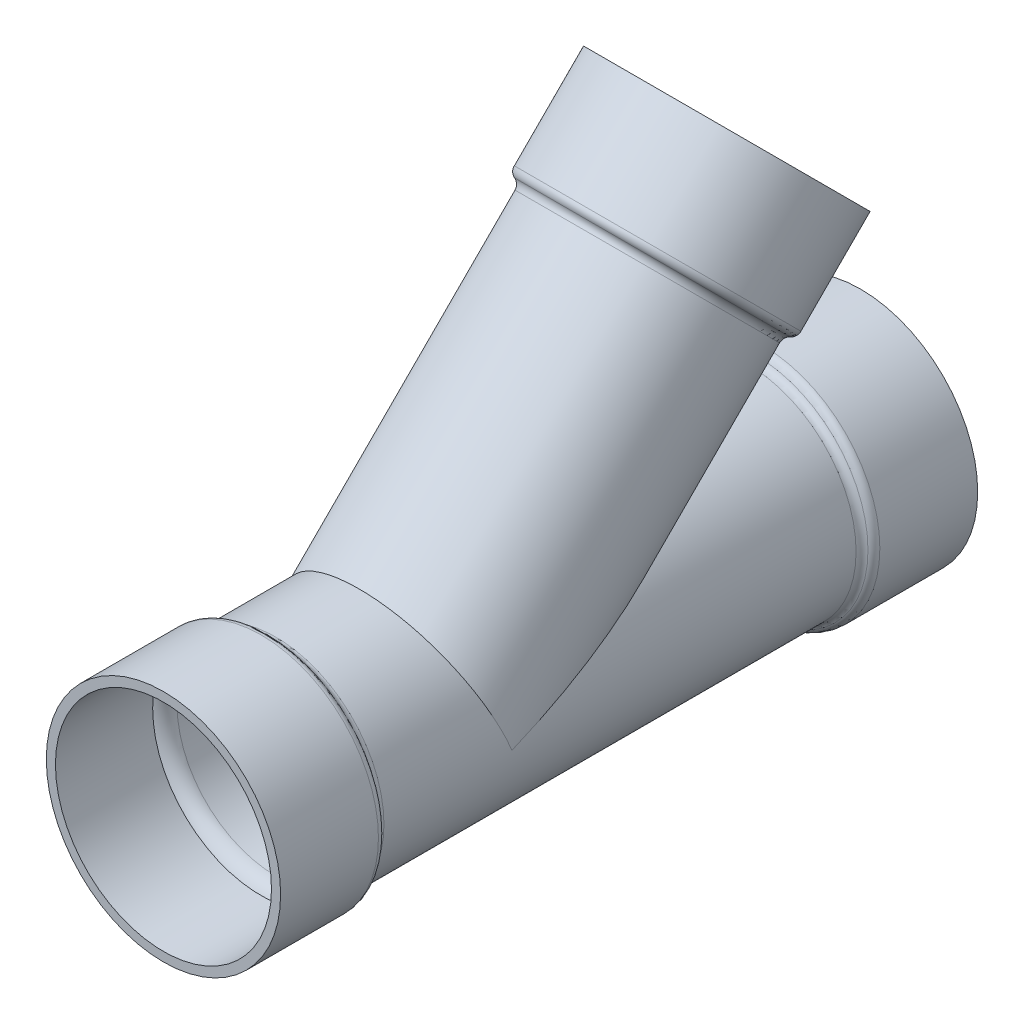
ISO-10303-21;
HEADER;
FILE_DESCRIPTION(('STEP AP214'),'2;1');
FILE_NAME('part.step','',(''),(''),'','','');
FILE_SCHEMA(('AUTOMOTIVE_DESIGN { 1 0 10303 214 1 1 1 1 }'));
ENDSEC;
DATA;
#1=APPLICATION_CONTEXT('core data for automotive mechanical design processes');
#2=APPLICATION_PROTOCOL_DEFINITION('international standard','automotive_design',2000,#1);
#3=PRODUCT_CONTEXT('',#1,'mechanical');
#4=PRODUCT('Part','Part','',(#3));
#5=PRODUCT_RELATED_PRODUCT_CATEGORY('part','',(#4));
#6=PRODUCT_DEFINITION_FORMATION('','',#4);
#7=PRODUCT_DEFINITION_CONTEXT('part definition',#1,'design');
#8=PRODUCT_DEFINITION('design','',#6,#7);
#9=PRODUCT_DEFINITION_SHAPE('','',#8);
#10=(LENGTH_UNIT() NAMED_UNIT(*) SI_UNIT(.MILLI.,.METRE.));
#11=(NAMED_UNIT(*) PLANE_ANGLE_UNIT() SI_UNIT($,.RADIAN.));
#12=(NAMED_UNIT(*) SI_UNIT($,.STERADIAN.) SOLID_ANGLE_UNIT());
#13=UNCERTAINTY_MEASURE_WITH_UNIT(LENGTH_MEASURE(1.E-05),#10,'distance_accuracy_value','');
#14=(GEOMETRIC_REPRESENTATION_CONTEXT(3) GLOBAL_UNCERTAINTY_ASSIGNED_CONTEXT((#13)) GLOBAL_UNIT_ASSIGNED_CONTEXT((#10,
#11,#12)) REPRESENTATION_CONTEXT('',''));
#15=CARTESIAN_POINT('',(0.,0.,0.));
#16=DIRECTION('',(0.,0.,1.));
#17=DIRECTION('',(1.,0.,0.));
#18=AXIS2_PLACEMENT_3D('',#15,#16,#17);
#19=CARTESIAN_POINT('',(0.,0.,84.1375));
#20=DIRECTION('',(0.,-0.707106781186549,0.707106781186546));
#21=DIRECTION('',(0.,-0.707106781186546,-0.707106781186549));
#22=AXIS2_PLACEMENT_3D('',#19,#20,#21);
#23=CYLINDRICAL_SURFACE('',#22,77.0255);
#24=CARTESIAN_POINT('',(0.,189.501384667397,-105.363884667396));
#25=DIRECTION('',(0.,-0.707106781186549,0.707106781186546));
#26=DIRECTION('',(0.,-0.707106781186546,-0.707106781186549));
#27=AXIS2_PLACEMENT_3D('',#24,#25,#26);
#28=CIRCLE('',#27,77.0255);
#29=CARTESIAN_POINT('',(0.,135.036131293112,-159.82913804168));
#30=VERTEX_POINT('',#29);
#31=EDGE_CURVE('E82',#30,#30,#28,.T.);
#32=ORIENTED_EDGE('',*,*,#31,.F.);
#33=EDGE_LOOP('',(#32));
#34=FACE_BOUND('',#33,.T.);
#35=CARTESIAN_POINT('',(0.,0.,84.1375));
#36=DIRECTION('',(0.,-0.923879532511286,-0.382683432365091));
#37=DIRECTION('',(0.,-0.382683432365091,0.923879532511286));
#38=AXIS2_PLACEMENT_3D('',#35,#36,#37);
#39=ELLIPSE('',#38,201.27733130217,77.0255);
#40=CARTESIAN_POINT('',(-77.0255,0.,84.1375));
#41=VERTEX_POINT('',#40);
#42=CARTESIAN_POINT('',(77.0255,1.25958571793709E-13,84.1374999999999));
#43=VERTEX_POINT('',#42);
#44=EDGE_CURVE('E74',#41,#43,#39,.T.);
#45=ORIENTED_EDGE('',*,*,#44,.T.);
#46=CARTESIAN_POINT('',(0.,0.,84.1375));
#47=DIRECTION('',(0.,-0.382683432365091,0.923879532511286));
#48=DIRECTION('',(0.,-0.923879532511286,-0.382683432365091));
#49=AXIS2_PLACEMENT_3D('',#46,#47,#48);
#50=ELLIPSE('',#49,83.3718004236218,77.0255);
#51=EDGE_CURVE('E60',#43,#41,#50,.T.);
#52=ORIENTED_EDGE('',*,*,#51,.T.);
#53=EDGE_LOOP('',(#45,#52));
#54=FACE_BOUND('',#53,.T.);
#55=ADVANCED_FACE('F42',(#34,#54),#23,.F.);
#56=CARTESIAN_POINT('',(0.,0.,168.70511138535));
#57=DIRECTION('',(0.,0.,1.));
#58=DIRECTION('',(1.,0.,0.));
#59=AXIS2_PLACEMENT_3D('',#56,#57,#58);
#60=CYLINDRICAL_SURFACE('',#59,84.1375);
#61=CARTESIAN_POINT('',(0.,0.,-183.857928285113));
#62=DIRECTION('',(0.,0.,1.));
#63=DIRECTION('',(1.,0.,0.));
#64=AXIS2_PLACEMENT_3D('',#61,#62,#63);
#65=CIRCLE('',#64,84.1375);
#66=CARTESIAN_POINT('',(84.1375,0.,-183.857928285113));
#67=VERTEX_POINT('',#66);
#68=EDGE_CURVE('E130',#67,#67,#65,.T.);
#69=ORIENTED_EDGE('',*,*,#68,.T.);
#70=EDGE_LOOP('',(#69));
#71=FACE_BOUND('',#70,.T.);
#72=CARTESIAN_POINT('',(0.,0.,183.857928285113));
#73=DIRECTION('',(0.,0.,1.));
#74=DIRECTION('',(1.,0.,0.));
#75=AXIS2_PLACEMENT_3D('',#72,#73,#74);
#76=CIRCLE('',#75,84.1375);
#77=CARTESIAN_POINT('',(84.1375,0.,183.857928285113));
#78=VERTEX_POINT('',#77);
#79=EDGE_CURVE('E126',#78,#78,#76,.T.);
#80=ORIENTED_EDGE('',*,*,#79,.F.);
#81=EDGE_LOOP('',(#80));
#82=FACE_BOUND('',#81,.T.);
#83=CARTESIAN_POINT('',(0.,0.,84.1375));
#84=DIRECTION('',(0.,-0.382683432365091,0.923879532511286));
#85=DIRECTION('',(0.,0.923879532511286,0.382683432365091));
#86=AXIS2_PLACEMENT_3D('',#83,#84,#85);
#87=ELLIPSE('',#86,91.0697737521013,84.1375);
#88=CARTESIAN_POINT('',(-84.1375,0.,84.1375));
#89=VERTEX_POINT('',#88);
#90=CARTESIAN_POINT('',(84.1375,0.,84.1375));
#91=VERTEX_POINT('',#90);
#92=EDGE_CURVE('E11',#89,#91,#87,.F.);
#93=ORIENTED_EDGE('',*,*,#92,.F.);
#94=CARTESIAN_POINT('',(0.,0.,84.1375));
#95=DIRECTION('',(0.,0.923879532511286,0.382683432365091));
#96=DIRECTION('',(0.,-0.382683432365091,0.923879532511286));
#97=AXIS2_PLACEMENT_3D('',#94,#95,#96);
#98=ELLIPSE('',#97,219.861882914572,84.1375);
#99=EDGE_CURVE('E51',#91,#89,#98,.T.);
#100=ORIENTED_EDGE('',*,*,#99,.F.);
#101=EDGE_LOOP('',(#93,#100));
#102=FACE_BOUND('',#101,.T.);
#103=ADVANCED_FACE('F149',(#71,#82,#102),#60,.T.);
#104=CARTESIAN_POINT('',(0.,0.,271.4625));
#105=DIRECTION('',(0.,0.,-1.));
#106=DIRECTION('',(-1.,0.,0.));
#107=AXIS2_PLACEMENT_3D('',#104,#105,#106);
#108=PLANE('',#107);
#109=CARTESIAN_POINT('',(0.,0.,271.4625));
#110=DIRECTION('',(0.,0.,1.));
#111=DIRECTION('',(1.,0.,0.));
#112=AXIS2_PLACEMENT_3D('',#109,#110,#111);
#113=CIRCLE('',#112,84.1374999999999);
#114=CARTESIAN_POINT('',(84.1374999999999,0.,271.4625));
#115=VERTEX_POINT('',#114);
#116=EDGE_CURVE('E189',#115,#115,#113,.T.);
#117=ORIENTED_EDGE('',*,*,#116,.F.);
#118=EDGE_LOOP('',(#117));
#119=FACE_BOUND('',#118,.T.);
#120=CARTESIAN_POINT('',(0.,0.,271.4625));
#121=DIRECTION('',(0.,0.,1.));
#122=DIRECTION('',(1.,0.,0.));
#123=AXIS2_PLACEMENT_3D('',#120,#121,#122);
#124=CIRCLE('',#123,91.2495);
#125=CARTESIAN_POINT('',(91.2495,0.,271.4625));
#126=VERTEX_POINT('',#125);
#127=EDGE_CURVE('E114',#126,#126,#124,.T.);
#128=ORIENTED_EDGE('',*,*,#127,.T.);
#129=EDGE_LOOP('',(#128));
#130=FACE_BOUND('',#129,.T.);
#131=ADVANCED_FACE('F44',(#119,#130),#108,.F.);
#132=CARTESIAN_POINT('',(0.,91.2495,-271.4625));
#133=DIRECTION('',(0.,0.,1.));
#134=DIRECTION('',(1.,0.,0.));
#135=AXIS2_PLACEMENT_3D('',#132,#133,#134);
#136=PLANE('',#135);
#137=CARTESIAN_POINT('',(0.,0.,-271.4625));
#138=DIRECTION('',(0.,0.,1.));
#139=DIRECTION('',(1.,0.,0.));
#140=AXIS2_PLACEMENT_3D('',#137,#138,#139);
#141=CIRCLE('',#140,84.1375);
#142=CARTESIAN_POINT('',(84.1375,0.,-271.4625));
#143=VERTEX_POINT('',#142);
#144=EDGE_CURVE('E184',#143,#143,#141,.T.);
#145=ORIENTED_EDGE('',*,*,#144,.T.);
#146=EDGE_LOOP('',(#145));
#147=FACE_BOUND('',#146,.T.);
#148=CARTESIAN_POINT('',(0.,0.,-271.4625));
#149=DIRECTION('',(0.,0.,1.));
#150=DIRECTION('',(1.,0.,0.));
#151=AXIS2_PLACEMENT_3D('',#148,#149,#150);
#152=CIRCLE('',#151,91.2495);
#153=CARTESIAN_POINT('',(91.2495,0.,-271.4625));
#154=VERTEX_POINT('',#153);
#155=EDGE_CURVE('E142',#154,#154,#152,.T.);
#156=ORIENTED_EDGE('',*,*,#155,.F.);
#157=EDGE_LOOP('',(#156));
#158=FACE_BOUND('',#157,.T.);
#159=ADVANCED_FACE('F157',(#147,#158),#136,.F.);
#160=CARTESIAN_POINT('',(0.,0.,168.70511138535));
#161=DIRECTION('',(0.,0.,1.));
#162=DIRECTION('',(1.,0.,0.));
#163=AXIS2_PLACEMENT_3D('',#160,#161,#162);
#164=CYLINDRICAL_SURFACE('',#163,91.2495);
#165=CARTESIAN_POINT('',(0.,0.,-195.2625));
#166=DIRECTION('',(0.,0.,1.));
#167=DIRECTION('',(1.,0.,0.));
#168=AXIS2_PLACEMENT_3D('',#165,#166,#167);
#169=CIRCLE('',#168,91.2495);
#170=CARTESIAN_POINT('',(91.2495,0.,-195.2625));
#171=VERTEX_POINT('',#170);
#172=EDGE_CURVE('E138',#171,#171,#169,.T.);
#173=ORIENTED_EDGE('',*,*,#172,.F.);
#174=EDGE_LOOP('',(#173));
#175=FACE_BOUND('',#174,.T.);
#176=ORIENTED_EDGE('',*,*,#155,.T.);
#177=EDGE_LOOP('',(#176));
#178=FACE_BOUND('',#177,.T.);
#179=ADVANCED_FACE('F173',(#175,#178),#164,.T.);
#180=CARTESIAN_POINT('',(0.,0.,-195.2625));
#181=DIRECTION('',(0.,0.,1.));
#182=DIRECTION('',(1.,0.,0.));
#183=AXIS2_PLACEMENT_3D('',#180,#181,#182);
#184=TOROIDAL_SURFACE('',#183,84.8995,6.34999999999998);
#185=CARTESIAN_POINT('',(0.,0.,-189.560214142557));
#186=DIRECTION('',(0.,0.,1.));
#187=DIRECTION('',(1.,0.,0.));
#188=AXIS2_PLACEMENT_3D('',#185,#186,#187);
#189=CIRCLE('',#188,87.6935);
#190=CARTESIAN_POINT('',(87.6935,0.,-189.560214142557));
#191=VERTEX_POINT('',#190);
#192=EDGE_CURVE('E134',#191,#191,#189,.T.);
#193=ORIENTED_EDGE('',*,*,#192,.F.);
#194=EDGE_LOOP('',(#193));
#195=FACE_BOUND('',#194,.T.);
#196=ORIENTED_EDGE('',*,*,#172,.T.);
#197=EDGE_LOOP('',(#196));
#198=FACE_BOUND('',#197,.T.);
#199=ADVANCED_FACE('F169',(#195,#198),#184,.T.);
#200=CARTESIAN_POINT('',(0.,0.,-183.857928285113));
#201=DIRECTION('',(0.,0.,1.));
#202=DIRECTION('',(1.,0.,0.));
#203=AXIS2_PLACEMENT_3D('',#200,#201,#202);
#204=TOROIDAL_SURFACE('',#203,90.4875,6.34999999999999);
#205=ORIENTED_EDGE('',*,*,#68,.F.);
#206=EDGE_LOOP('',(#205));
#207=FACE_BOUND('',#206,.T.);
#208=ORIENTED_EDGE('',*,*,#192,.T.);
#209=EDGE_LOOP('',(#208));
#210=FACE_BOUND('',#209,.T.);
#211=ADVANCED_FACE('F166',(#207,#210),#204,.F.);
#212=CARTESIAN_POINT('',(0.,0.,183.857928285113));
#213=DIRECTION('',(0.,0.,1.));
#214=DIRECTION('',(1.,0.,0.));
#215=AXIS2_PLACEMENT_3D('',#212,#213,#214);
#216=TOROIDAL_SURFACE('',#215,90.4875,6.34999999999999);
#217=CARTESIAN_POINT('',(0.,0.,189.560214142557));
#218=DIRECTION('',(0.,0.,1.));
#219=DIRECTION('',(1.,0.,0.));
#220=AXIS2_PLACEMENT_3D('',#217,#218,#219);
#221=CIRCLE('',#220,87.6935);
#222=CARTESIAN_POINT('',(87.6935,0.,189.560214142557));
#223=VERTEX_POINT('',#222);
#224=EDGE_CURVE('E122',#223,#223,#221,.T.);
#225=ORIENTED_EDGE('',*,*,#224,.F.);
#226=EDGE_LOOP('',(#225));
#227=FACE_BOUND('',#226,.T.);
#228=ORIENTED_EDGE('',*,*,#79,.T.);
#229=EDGE_LOOP('',(#228));
#230=FACE_BOUND('',#229,.T.);
#231=ADVANCED_FACE('F164',(#227,#230),#216,.F.);
#232=CARTESIAN_POINT('',(0.,0.,195.2625));
#233=DIRECTION('',(0.,0.,1.));
#234=DIRECTION('',(1.,0.,0.));
#235=AXIS2_PLACEMENT_3D('',#232,#233,#234);
#236=TOROIDAL_SURFACE('',#235,84.8995,6.34999999999998);
#237=CARTESIAN_POINT('',(0.,0.,195.2625));
#238=DIRECTION('',(0.,0.,1.));
#239=DIRECTION('',(1.,0.,0.));
#240=AXIS2_PLACEMENT_3D('',#237,#238,#239);
#241=CIRCLE('',#240,91.2495);
#242=CARTESIAN_POINT('',(91.2495,0.,195.2625));
#243=VERTEX_POINT('',#242);
#244=EDGE_CURVE('E118',#243,#243,#241,.T.);
#245=ORIENTED_EDGE('',*,*,#244,.F.);
#246=EDGE_LOOP('',(#245));
#247=FACE_BOUND('',#246,.T.);
#248=ORIENTED_EDGE('',*,*,#224,.T.);
#249=EDGE_LOOP('',(#248));
#250=FACE_BOUND('',#249,.T.);
#251=ADVANCED_FACE('F257',(#247,#250),#236,.T.);
#252=CARTESIAN_POINT('',(0.,0.,168.70511138535));
#253=DIRECTION('',(0.,0.,1.));
#254=DIRECTION('',(1.,0.,0.));
#255=AXIS2_PLACEMENT_3D('',#252,#253,#254);
#256=CYLINDRICAL_SURFACE('',#255,91.2495);
#257=ORIENTED_EDGE('',*,*,#127,.F.);
#258=EDGE_LOOP('',(#257));
#259=FACE_BOUND('',#258,.T.);
#260=ORIENTED_EDGE('',*,*,#244,.T.);
#261=EDGE_LOOP('',(#260));
#262=FACE_BOUND('',#261,.T.);
#263=ADVANCED_FACE('F240',(#259,#262),#256,.T.);
#264=CARTESIAN_POINT('',(0.,0.,84.1375));
#265=DIRECTION('',(0.,-0.707106781186549,0.707106781186546));
#266=DIRECTION('',(0.,-0.707106781186546,-0.707106781186549));
#267=AXIS2_PLACEMENT_3D('',#264,#265,#266);
#268=CYLINDRICAL_SURFACE('',#267,84.1375);
#269=CARTESIAN_POINT('',(0.,189.501384667397,-105.363884667396));
#270=DIRECTION('',(0.,-0.707106781186549,0.707106781186546));
#271=DIRECTION('',(0.,-0.707106781186546,-0.707106781186549));
#272=AXIS2_PLACEMENT_3D('',#269,#270,#271);
#273=CIRCLE('',#272,84.1375);
#274=CARTESIAN_POINT('',(0.,130.007187865314,-164.858081469479));
#275=VERTEX_POINT('',#274);
#276=EDGE_CURVE('E98',#275,#275,#273,.T.);
#277=ORIENTED_EDGE('',*,*,#276,.T.);
#278=EDGE_LOOP('',(#277));
#279=FACE_BOUND('',#278,.T.);
#280=ORIENTED_EDGE('',*,*,#99,.T.);
#281=ORIENTED_EDGE('',*,*,#92,.T.);
#282=EDGE_LOOP('',(#280,#281));
#283=FACE_BOUND('',#282,.T.);
#284=ADVANCED_FACE('F148',(#279,#283),#268,.T.);
#285=CARTESIAN_POINT('',(0.,315.970311619818,-102.786531160054));
#286=DIRECTION('',(0.,-0.707106781186549,0.707106781186546));
#287=DIRECTION('',(0.,-0.707106781186546,-0.707106781186549));
#288=AXIS2_PLACEMENT_3D('',#285,#286,#287);
#289=PLANE('',#288);
#290=CARTESIAN_POINT('',(0.,251.447171389937,-167.309671389936));
#291=DIRECTION('',(0.,-0.707106781186549,0.707106781186546));
#292=DIRECTION('',(0.,-0.707106781186546,-0.707106781186549));
#293=AXIS2_PLACEMENT_3D('',#290,#291,#292);
#294=CIRCLE('',#293,84.1375);
#295=CARTESIAN_POINT('',(0.,191.952974587854,-226.803868192019));
#296=VERTEX_POINT('',#295);
#297=EDGE_CURVE('E94',#296,#296,#294,.T.);
#298=ORIENTED_EDGE('',*,*,#297,.T.);
#299=EDGE_LOOP('',(#298));
#300=FACE_BOUND('',#299,.T.);
#301=CARTESIAN_POINT('',(0.,251.447171389937,-167.309671389936));
#302=DIRECTION('',(0.,-0.707106781186549,0.707106781186546));
#303=DIRECTION('',(0.,-0.707106781186546,-0.707106781186549));
#304=AXIS2_PLACEMENT_3D('',#301,#302,#303);
#305=CIRCLE('',#304,91.2495);
#306=CARTESIAN_POINT('',(0.,186.924031160055,-231.832811619818));
#307=VERTEX_POINT('',#306);
#308=EDGE_CURVE('E110',#307,#307,#305,.T.);
#309=ORIENTED_EDGE('',*,*,#308,.F.);
#310=EDGE_LOOP('',(#309));
#311=FACE_BOUND('',#310,.T.);
#312=ADVANCED_FACE('F239',(#300,#311),#289,.F.);
#313=CARTESIAN_POINT('',(0.,0.,84.1375));
#314=DIRECTION('',(0.,-0.707106781186549,0.707106781186546));
#315=DIRECTION('',(0.,-0.707106781186546,-0.707106781186549));
#316=AXIS2_PLACEMENT_3D('',#313,#314,#315);
#317=CYLINDRICAL_SURFACE('',#316,91.2495);
#318=CARTESIAN_POINT('',(0.,197.565634663522,-113.428134663521));
#319=DIRECTION('',(0.,-0.707106781186549,0.707106781186546));
#320=DIRECTION('',(0.,-0.707106781186546,-0.707106781186549));
#321=AXIS2_PLACEMENT_3D('',#318,#319,#320);
#322=CIRCLE('',#321,91.2495000000001);
#323=CARTESIAN_POINT('',(0.,133.04249443364,-177.951274893403));
#324=VERTEX_POINT('',#323);
#325=EDGE_CURVE('E106',#324,#324,#322,.T.);
#326=ORIENTED_EDGE('',*,*,#325,.F.);
#327=EDGE_LOOP('',(#326));
#328=FACE_BOUND('',#327,.T.);
#329=ORIENTED_EDGE('',*,*,#308,.T.);
#330=EDGE_LOOP('',(#329));
#331=FACE_BOUND('',#330,.T.);
#332=ADVANCED_FACE('F248',(#328,#331),#317,.T.);
#333=CARTESIAN_POINT('',(0.,197.565634663522,-113.428134663521));
#334=DIRECTION('',(0.,-0.707106781186549,0.707106781186546));
#335=DIRECTION('',(0.,-0.707106781186546,-0.707106781186549));
#336=AXIS2_PLACEMENT_3D('',#333,#334,#335);
#337=TOROIDAL_SURFACE('',#336,84.8995,6.35000000000002);
#338=CARTESIAN_POINT('',(0.,193.533509665459,-109.396009665459));
#339=DIRECTION('',(0.,-0.707106781186549,0.707106781186546));
#340=DIRECTION('',(0.,-0.707106781186546,-0.707106781186549));
#341=AXIS2_PLACEMENT_3D('',#338,#339,#340);
#342=CIRCLE('',#341,87.6935);
#343=CARTESIAN_POINT('',(0.,131.524841149477,-171.404678181441));
#344=VERTEX_POINT('',#343);
#345=EDGE_CURVE('E102',#344,#344,#342,.T.);
#346=ORIENTED_EDGE('',*,*,#345,.F.);
#347=EDGE_LOOP('',(#346));
#348=FACE_BOUND('',#347,.T.);
#349=ORIENTED_EDGE('',*,*,#325,.T.);
#350=EDGE_LOOP('',(#349));
#351=FACE_BOUND('',#350,.T.);
#352=ADVANCED_FACE('F244',(#348,#351),#337,.T.);
#353=CARTESIAN_POINT('',(0.,189.501384667397,-105.363884667396));
#354=DIRECTION('',(0.,-0.707106781186549,0.707106781186546));
#355=DIRECTION('',(0.,-0.707106781186546,-0.707106781186549));
#356=AXIS2_PLACEMENT_3D('',#353,#354,#355);
#357=TOROIDAL_SURFACE('',#356,90.4875,6.34999999999996);
#358=ORIENTED_EDGE('',*,*,#276,.F.);
#359=EDGE_LOOP('',(#358));
#360=FACE_BOUND('',#359,.T.);
#361=ORIENTED_EDGE('',*,*,#345,.T.);
#362=EDGE_LOOP('',(#361));
#363=FACE_BOUND('',#362,.T.);
#364=ADVANCED_FACE('F235',(#360,#363),#357,.F.);
#365=CARTESIAN_POINT('',(0.,0.,84.1375));
#366=DIRECTION('',(0.,-0.707106781186549,0.707106781186546));
#367=DIRECTION('',(0.,-0.707106781186546,-0.707106781186549));
#368=AXIS2_PLACEMENT_3D('',#365,#366,#367);
#369=CYLINDRICAL_SURFACE('',#368,84.1375);
#370=CARTESIAN_POINT('',(0.,197.894922181461,-113.75742218146));
#371=DIRECTION('',(0.,-0.707106781186549,0.707106781186546));
#372=DIRECTION('',(0.,-0.707106781186546,-0.707106781186549));
#373=AXIS2_PLACEMENT_3D('',#370,#371,#372);
#374=CIRCLE('',#373,84.1375);
#375=CARTESIAN_POINT('',(0.,138.400725379378,-173.251618983543));
#376=VERTEX_POINT('',#375);
#377=EDGE_CURVE('E87',#376,#376,#374,.T.);
#378=ORIENTED_EDGE('',*,*,#377,.T.);
#379=EDGE_LOOP('',(#378));
#380=FACE_BOUND('',#379,.T.);
#381=ORIENTED_EDGE('',*,*,#297,.F.);
#382=EDGE_LOOP('',(#381));
#383=FACE_BOUND('',#382,.T.);
#384=ADVANCED_FACE('F231',(#380,#383),#369,.F.);
#385=CARTESIAN_POINT('',(0.,189.501384667397,-105.363884667396));
#386=DIRECTION('',(0.,-0.707106781186549,0.707106781186546));
#387=DIRECTION('',(0.,-0.707106781186546,-0.707106781186549));
#388=AXIS2_PLACEMENT_3D('',#385,#386,#387);
#389=TOROIDAL_SURFACE('',#388,90.4875,13.462);
#390=ORIENTED_EDGE('',*,*,#31,.T.);
#391=EDGE_LOOP('',(#390));
#392=FACE_BOUND('',#391,.T.);
#393=ORIENTED_EDGE('',*,*,#377,.F.);
#394=EDGE_LOOP('',(#393));
#395=FACE_BOUND('',#394,.T.);
#396=ADVANCED_FACE('F225',(#392,#395),#389,.T.);
#397=CARTESIAN_POINT('',(0.,0.,-183.857928285113));
#398=DIRECTION('',(0.,0.,1.));
#399=DIRECTION('',(1.,0.,0.));
#400=AXIS2_PLACEMENT_3D('',#397,#398,#399);
#401=TOROIDAL_SURFACE('',#400,90.4875,13.462);
#402=CARTESIAN_POINT('',(0.,0.,-183.857928285113));
#403=DIRECTION('',(0.,0.,1.));
#404=DIRECTION('',(1.,0.,0.));
#405=AXIS2_PLACEMENT_3D('',#402,#403,#404);
#406=CIRCLE('',#405,77.0255);
#407=CARTESIAN_POINT('',(77.0255,0.,-183.857928285113));
#408=VERTEX_POINT('',#407);
#409=EDGE_CURVE('E79',#408,#408,#406,.T.);
#410=ORIENTED_EDGE('',*,*,#409,.T.);
#411=EDGE_LOOP('',(#410));
#412=FACE_BOUND('',#411,.T.);
#413=CARTESIAN_POINT('',(0.,0.,-195.72818287379));
#414=DIRECTION('',(0.,0.,1.));
#415=DIRECTION('',(1.,0.,0.));
#416=AXIS2_PLACEMENT_3D('',#413,#414,#415);
#417=CIRCLE('',#416,84.1375);
#418=CARTESIAN_POINT('',(84.1375,0.,-195.72818287379));
#419=VERTEX_POINT('',#418);
#420=EDGE_CURVE('E190',#419,#419,#417,.T.);
#421=ORIENTED_EDGE('',*,*,#420,.F.);
#422=EDGE_LOOP('',(#421));
#423=FACE_BOUND('',#422,.T.);
#424=ADVANCED_FACE('F212',(#412,#423),#401,.T.);
#425=CARTESIAN_POINT('',(0.,0.,168.70511138535));
#426=DIRECTION('',(0.,0.,1.));
#427=DIRECTION('',(1.,0.,0.));
#428=AXIS2_PLACEMENT_3D('',#425,#426,#427);
#429=CYLINDRICAL_SURFACE('',#428,77.0255);
#430=ORIENTED_EDGE('',*,*,#44,.F.);
#431=ORIENTED_EDGE('',*,*,#51,.F.);
#432=EDGE_LOOP('',(#430,#431));
#433=FACE_BOUND('',#432,.T.);
#434=CARTESIAN_POINT('',(0.,0.,183.857928285113));
#435=DIRECTION('',(0.,0.,1.));
#436=DIRECTION('',(1.,0.,0.));
#437=AXIS2_PLACEMENT_3D('',#434,#435,#436);
#438=CIRCLE('',#437,77.0255);
#439=CARTESIAN_POINT('',(77.0255,0.,183.857928285113));
#440=VERTEX_POINT('',#439);
#441=EDGE_CURVE('E204',#440,#440,#438,.T.);
#442=ORIENTED_EDGE('',*,*,#441,.T.);
#443=EDGE_LOOP('',(#442));
#444=FACE_BOUND('',#443,.T.);
#445=ORIENTED_EDGE('',*,*,#409,.F.);
#446=EDGE_LOOP('',(#445));
#447=FACE_BOUND('',#446,.T.);
#448=ADVANCED_FACE('F75',(#433,#444,#447),#429,.F.);
#449=CARTESIAN_POINT('',(0.,0.,183.857928285113));
#450=DIRECTION('',(0.,0.,1.));
#451=DIRECTION('',(1.,0.,0.));
#452=AXIS2_PLACEMENT_3D('',#449,#450,#451);
#453=TOROIDAL_SURFACE('',#452,90.4875,13.462);
#454=CARTESIAN_POINT('',(0.,0.,195.72818287379));
#455=DIRECTION('',(0.,0.,1.));
#456=DIRECTION('',(1.,0.,0.));
#457=AXIS2_PLACEMENT_3D('',#454,#455,#456);
#458=CIRCLE('',#457,84.1375);
#459=CARTESIAN_POINT('',(84.1375,0.,195.72818287379));
#460=VERTEX_POINT('',#459);
#461=EDGE_CURVE('E196',#460,#460,#458,.T.);
#462=ORIENTED_EDGE('',*,*,#461,.T.);
#463=EDGE_LOOP('',(#462));
#464=FACE_BOUND('',#463,.T.);
#465=ORIENTED_EDGE('',*,*,#441,.F.);
#466=EDGE_LOOP('',(#465));
#467=FACE_BOUND('',#466,.T.);
#468=ADVANCED_FACE('F216',(#464,#467),#453,.T.);
#469=CARTESIAN_POINT('',(0.,0.,168.70511138535));
#470=DIRECTION('',(0.,0.,1.));
#471=DIRECTION('',(1.,0.,0.));
#472=AXIS2_PLACEMENT_3D('',#469,#470,#471);
#473=CYLINDRICAL_SURFACE('',#472,84.1374999999999);
#474=ORIENTED_EDGE('',*,*,#116,.T.);
#475=EDGE_LOOP('',(#474));
#476=FACE_BOUND('',#475,.T.);
#477=ORIENTED_EDGE('',*,*,#461,.F.);
#478=EDGE_LOOP('',(#477));
#479=FACE_BOUND('',#478,.T.);
#480=ADVANCED_FACE('F222',(#476,#479),#473,.F.);
#481=CARTESIAN_POINT('',(0.,0.,168.70511138535));
#482=DIRECTION('',(0.,0.,1.));
#483=DIRECTION('',(1.,0.,0.));
#484=AXIS2_PLACEMENT_3D('',#481,#482,#483);
#485=CYLINDRICAL_SURFACE('',#484,84.1375);
#486=ORIENTED_EDGE('',*,*,#420,.T.);
#487=EDGE_LOOP('',(#486));
#488=FACE_BOUND('',#487,.T.);
#489=ORIENTED_EDGE('',*,*,#144,.F.);
#490=EDGE_LOOP('',(#489));
#491=FACE_BOUND('',#490,.T.);
#492=ADVANCED_FACE('F422',(#488,#491),#485,.F.);
#493=CLOSED_SHELL('',(#55,#103,#131,#159,#179,#199,#211,#231,#251,#263,#284,#312,#332,#352,#364,
#384,#396,#424,#448,#468,#480,#492));
#494=MANIFOLD_SOLID_BREP('B2',#493);
#495=ADVANCED_BREP_SHAPE_REPRESENTATION('',(#18,#494),#14);
#496=SHAPE_DEFINITION_REPRESENTATION(#9,#495);
ENDSEC;
END-ISO-10303-21;
